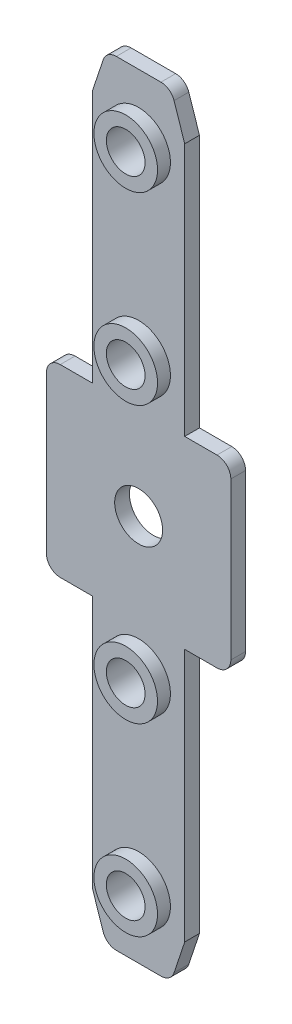
ISO-10303-21;
HEADER;
FILE_DESCRIPTION(('STEP AP214'),'2;1');
FILE_NAME('part.step','',(''),(''),'','','');
FILE_SCHEMA(('AUTOMOTIVE_DESIGN { 1 0 10303 214 1 1 1 1 }'));
ENDSEC;
DATA;
#1=APPLICATION_CONTEXT('core data for automotive mechanical design processes');
#2=APPLICATION_PROTOCOL_DEFINITION('international standard','automotive_design',2000,#1);
#3=PRODUCT_CONTEXT('',#1,'mechanical');
#4=PRODUCT('Part','Part','',(#3));
#5=PRODUCT_RELATED_PRODUCT_CATEGORY('part','',(#4));
#6=PRODUCT_DEFINITION_FORMATION('','',#4);
#7=PRODUCT_DEFINITION_CONTEXT('part definition',#1,'design');
#8=PRODUCT_DEFINITION('design','',#6,#7);
#9=PRODUCT_DEFINITION_SHAPE('','',#8);
#10=(LENGTH_UNIT() NAMED_UNIT(*) SI_UNIT(.MILLI.,.METRE.));
#11=(NAMED_UNIT(*) PLANE_ANGLE_UNIT() SI_UNIT($,.RADIAN.));
#12=(NAMED_UNIT(*) SI_UNIT($,.STERADIAN.) SOLID_ANGLE_UNIT());
#13=UNCERTAINTY_MEASURE_WITH_UNIT(LENGTH_MEASURE(1.E-05),#10,'distance_accuracy_value','');
#14=(GEOMETRIC_REPRESENTATION_CONTEXT(3) GLOBAL_UNCERTAINTY_ASSIGNED_CONTEXT((#13)) GLOBAL_UNIT_ASSIGNED_CONTEXT((#10,
#11,#12)) REPRESENTATION_CONTEXT('',''));
#15=CARTESIAN_POINT('',(0.,0.,0.));
#16=DIRECTION('',(0.,0.,1.));
#17=DIRECTION('',(1.,0.,0.));
#18=AXIS2_PLACEMENT_3D('',#15,#16,#17);
#19=CARTESIAN_POINT('',(-2.41886116991581,40.485,1.6));
#20=DIRECTION('',(0.,0.,-1.));
#21=DIRECTION('',(-1.,0.,0.));
#22=AXIS2_PLACEMENT_3D('',#19,#20,#21);
#23=PLANE('',#22);
#24=CARTESIAN_POINT('',(0.,-14.95,1.6));
#25=DIRECTION('',(0.,0.,-1.));
#26=DIRECTION('',(-1.,0.,0.));
#27=AXIS2_PLACEMENT_3D('',#24,#25,#26);
#28=CIRCLE('',#27,3.45);
#29=CARTESIAN_POINT('',(-3.45,-14.95,1.6));
#30=VERTEX_POINT('',#29);
#31=EDGE_CURVE('E44',#30,#30,#28,.F.);
#32=ORIENTED_EDGE('',*,*,#31,.F.);
#33=EDGE_LOOP('',(#32));
#34=FACE_BOUND('',#33,.T.);
#35=CARTESIAN_POINT('',(0.,14.95,1.6));
#36=DIRECTION('',(0.,0.,-1.));
#37=DIRECTION('',(-1.,0.,0.));
#38=AXIS2_PLACEMENT_3D('',#35,#36,#37);
#39=CIRCLE('',#38,3.45);
#40=CARTESIAN_POINT('',(-3.45,14.95,1.6));
#41=VERTEX_POINT('',#40);
#42=EDGE_CURVE('E339',#41,#41,#39,.F.);
#43=ORIENTED_EDGE('',*,*,#42,.F.);
#44=EDGE_LOOP('',(#43));
#45=FACE_BOUND('',#44,.T.);
#46=DIRECTION('',(0.,-1.,0.));
#47=VECTOR('',#46,1.);
#48=CARTESIAN_POINT('',(-5.,10.,1.6));
#49=LINE('',#48,#47);
#50=CARTESIAN_POINT('',(-5.,37.485,1.6));
#51=VERTEX_POINT('',#50);
#52=CARTESIAN_POINT('',(-5.,10.,1.6));
#53=VERTEX_POINT('',#52);
#54=EDGE_CURVE('E276',#51,#53,#49,.T.);
#55=ORIENTED_EDGE('',*,*,#54,.T.);
#56=DIRECTION('',(-1.,0.,0.));
#57=VECTOR('',#56,1.);
#58=CARTESIAN_POINT('',(-8.49999999999999,10.,1.6));
#59=LINE('',#58,#57);
#60=CARTESIAN_POINT('',(-8.49999999999999,10.,1.6));
#61=VERTEX_POINT('',#60);
#62=EDGE_CURVE('E144',#53,#61,#59,.T.);
#63=ORIENTED_EDGE('',*,*,#62,.T.);
#64=CARTESIAN_POINT('',(-8.5,8.5,1.6));
#65=DIRECTION('',(0.,0.,1.));
#66=DIRECTION('',(-1.,0.,0.));
#67=AXIS2_PLACEMENT_3D('',#64,#65,#66);
#68=CIRCLE('',#67,1.5);
#69=CARTESIAN_POINT('',(-10.,8.49999999999999,1.6));
#70=VERTEX_POINT('',#69);
#71=EDGE_CURVE('E470',#61,#70,#68,.T.);
#72=ORIENTED_EDGE('',*,*,#71,.T.);
#73=DIRECTION('',(0.,-1.,0.));
#74=VECTOR('',#73,1.);
#75=CARTESIAN_POINT('',(-10.,-8.49999999999999,1.6));
#76=LINE('',#75,#74);
#77=CARTESIAN_POINT('',(-10.,-8.49999999999999,1.6));
#78=VERTEX_POINT('',#77);
#79=EDGE_CURVE('E482',#70,#78,#76,.T.);
#80=ORIENTED_EDGE('',*,*,#79,.T.);
#81=CARTESIAN_POINT('',(-8.5,-8.5,1.6));
#82=DIRECTION('',(0.,0.,1.));
#83=DIRECTION('',(-1.,0.,0.));
#84=AXIS2_PLACEMENT_3D('',#81,#82,#83);
#85=CIRCLE('',#84,1.5);
#86=CARTESIAN_POINT('',(-8.49999999999999,-10.,1.6));
#87=VERTEX_POINT('',#86);
#88=EDGE_CURVE('E479',#78,#87,#85,.T.);
#89=ORIENTED_EDGE('',*,*,#88,.T.);
#90=DIRECTION('',(1.,0.,0.));
#91=VECTOR('',#90,1.);
#92=CARTESIAN_POINT('',(-8.49999999999999,-10.,1.6));
#93=LINE('',#92,#91);
#94=CARTESIAN_POINT('',(-5.,-10.,1.6));
#95=VERTEX_POINT('',#94);
#96=EDGE_CURVE('E481',#87,#95,#93,.T.);
#97=ORIENTED_EDGE('',*,*,#96,.T.);
#98=DIRECTION('',(0.,-1.,0.));
#99=VECTOR('',#98,1.);
#100=CARTESIAN_POINT('',(-5.,-10.,1.6));
#101=LINE('',#100,#99);
#102=CARTESIAN_POINT('',(-5.,-37.485,1.6));
#103=VERTEX_POINT('',#102);
#104=EDGE_CURVE('E484',#95,#103,#101,.T.);
#105=ORIENTED_EDGE('',*,*,#104,.T.);
#106=DIRECTION('',(0.316227766016838,-0.948683298050514,0.));
#107=VECTOR('',#106,1.);
#108=CARTESIAN_POINT('',(-5.,-37.485,1.6));
#109=LINE('',#108,#107);
#110=CARTESIAN_POINT('',(-3.84188611699158,-40.9593416490252,1.6));
#111=VERTEX_POINT('',#110);
#112=EDGE_CURVE('E490',#103,#111,#109,.T.);
#113=ORIENTED_EDGE('',*,*,#112,.T.);
#114=CARTESIAN_POINT('',(-2.41886116991581,-40.485,1.6));
#115=DIRECTION('',(0.,0.,1.));
#116=DIRECTION('',(-1.,0.,0.));
#117=AXIS2_PLACEMENT_3D('',#114,#115,#116);
#118=CIRCLE('',#117,1.5);
#119=CARTESIAN_POINT('',(-2.4188611699158,-41.985,1.6));
#120=VERTEX_POINT('',#119);
#121=EDGE_CURVE('E492',#111,#120,#118,.T.);
#122=ORIENTED_EDGE('',*,*,#121,.T.);
#123=DIRECTION('',(1.,0.,0.));
#124=VECTOR('',#123,1.);
#125=CARTESIAN_POINT('',(-2.4188611699158,-41.985,1.6));
#126=LINE('',#125,#124);
#127=CARTESIAN_POINT('',(2.4188611699158,-41.985,1.6));
#128=VERTEX_POINT('',#127);
#129=EDGE_CURVE('E494',#120,#128,#126,.T.);
#130=ORIENTED_EDGE('',*,*,#129,.T.);
#131=CARTESIAN_POINT('',(2.41886116991581,-40.485,1.6));
#132=DIRECTION('',(0.,0.,1.));
#133=DIRECTION('',(-1.,0.,0.));
#134=AXIS2_PLACEMENT_3D('',#131,#132,#133);
#135=CIRCLE('',#134,1.5);
#136=CARTESIAN_POINT('',(3.84188611699158,-40.9593416490252,1.6));
#137=VERTEX_POINT('',#136);
#138=EDGE_CURVE('E496',#128,#137,#135,.T.);
#139=ORIENTED_EDGE('',*,*,#138,.T.);
#140=DIRECTION('',(0.316227766016838,0.948683298050514,0.));
#141=VECTOR('',#140,1.);
#142=CARTESIAN_POINT('',(5.,-37.485,1.6));
#143=LINE('',#142,#141);
#144=CARTESIAN_POINT('',(5.,-37.485,1.6));
#145=VERTEX_POINT('',#144);
#146=EDGE_CURVE('E498',#137,#145,#143,.T.);
#147=ORIENTED_EDGE('',*,*,#146,.T.);
#148=DIRECTION('',(0.,1.,0.));
#149=VECTOR('',#148,1.);
#150=CARTESIAN_POINT('',(5.,-10.,1.6));
#151=LINE('',#150,#149);
#152=CARTESIAN_POINT('',(5.,-10.,1.6));
#153=VERTEX_POINT('',#152);
#154=EDGE_CURVE('E500',#145,#153,#151,.T.);
#155=ORIENTED_EDGE('',*,*,#154,.T.);
#156=DIRECTION('',(1.,0.,0.));
#157=VECTOR('',#156,1.);
#158=CARTESIAN_POINT('',(8.49999999999999,-10.,1.6));
#159=LINE('',#158,#157);
#160=CARTESIAN_POINT('',(8.49999999999999,-10.,1.6));
#161=VERTEX_POINT('',#160);
#162=EDGE_CURVE('E502',#153,#161,#159,.T.);
#163=ORIENTED_EDGE('',*,*,#162,.T.);
#164=CARTESIAN_POINT('',(8.5,-8.5,1.6));
#165=DIRECTION('',(0.,0.,1.));
#166=DIRECTION('',(1.,0.,0.));
#167=AXIS2_PLACEMENT_3D('',#164,#165,#166);
#168=CIRCLE('',#167,1.5);
#169=CARTESIAN_POINT('',(10.,-8.49999999999999,1.6));
#170=VERTEX_POINT('',#169);
#171=EDGE_CURVE('E504',#161,#170,#168,.T.);
#172=ORIENTED_EDGE('',*,*,#171,.T.);
#173=DIRECTION('',(0.,1.,0.));
#174=VECTOR('',#173,1.);
#175=CARTESIAN_POINT('',(10.,-8.49999999999999,1.6));
#176=LINE('',#175,#174);
#177=CARTESIAN_POINT('',(10.,8.49999999999999,1.6));
#178=VERTEX_POINT('',#177);
#179=EDGE_CURVE('E506',#170,#178,#176,.T.);
#180=ORIENTED_EDGE('',*,*,#179,.T.);
#181=CARTESIAN_POINT('',(8.5,8.5,1.6));
#182=DIRECTION('',(0.,0.,1.));
#183=DIRECTION('',(-1.,0.,0.));
#184=AXIS2_PLACEMENT_3D('',#181,#182,#183);
#185=CIRCLE('',#184,1.5);
#186=CARTESIAN_POINT('',(8.49999999999999,10.,1.6));
#187=VERTEX_POINT('',#186);
#188=EDGE_CURVE('E508',#178,#187,#185,.T.);
#189=ORIENTED_EDGE('',*,*,#188,.T.);
#190=DIRECTION('',(-1.,0.,0.));
#191=VECTOR('',#190,1.);
#192=CARTESIAN_POINT('',(8.49999999999999,10.,1.6));
#193=LINE('',#192,#191);
#194=CARTESIAN_POINT('',(5.,10.,1.6));
#195=VERTEX_POINT('',#194);
#196=EDGE_CURVE('E510',#187,#195,#193,.T.);
#197=ORIENTED_EDGE('',*,*,#196,.T.);
#198=DIRECTION('',(0.,1.,0.));
#199=VECTOR('',#198,1.);
#200=CARTESIAN_POINT('',(5.,10.,1.6));
#201=LINE('',#200,#199);
#202=CARTESIAN_POINT('',(5.,37.485,1.6));
#203=VERTEX_POINT('',#202);
#204=EDGE_CURVE('E512',#195,#203,#201,.T.);
#205=ORIENTED_EDGE('',*,*,#204,.T.);
#206=DIRECTION('',(-0.316227766016837,0.948683298050514,0.));
#207=VECTOR('',#206,1.);
#208=CARTESIAN_POINT('',(5.,37.485,1.6));
#209=LINE('',#208,#207);
#210=CARTESIAN_POINT('',(3.84188611699158,40.9593416490253,1.6));
#211=VERTEX_POINT('',#210);
#212=EDGE_CURVE('E514',#203,#211,#209,.T.);
#213=ORIENTED_EDGE('',*,*,#212,.T.);
#214=CARTESIAN_POINT('',(2.41886116991581,40.485,1.6));
#215=DIRECTION('',(0.,0.,1.));
#216=DIRECTION('',(1.,0.,0.));
#217=AXIS2_PLACEMENT_3D('',#214,#215,#216);
#218=CIRCLE('',#217,1.5);
#219=CARTESIAN_POINT('',(2.4188611699158,41.985,1.6));
#220=VERTEX_POINT('',#219);
#221=EDGE_CURVE('E211',#211,#220,#218,.T.);
#222=ORIENTED_EDGE('',*,*,#221,.T.);
#223=DIRECTION('',(-1.,0.,0.));
#224=VECTOR('',#223,1.);
#225=CARTESIAN_POINT('',(-2.4188611699158,41.985,1.6));
#226=LINE('',#225,#224);
#227=CARTESIAN_POINT('',(-2.4188611699158,41.985,1.6));
#228=VERTEX_POINT('',#227);
#229=EDGE_CURVE('E205',#220,#228,#226,.T.);
#230=ORIENTED_EDGE('',*,*,#229,.T.);
#231=CARTESIAN_POINT('',(-2.41886116991581,40.485,1.6));
#232=DIRECTION('',(0.,0.,1.));
#233=DIRECTION('',(-1.,0.,0.));
#234=AXIS2_PLACEMENT_3D('',#231,#232,#233);
#235=CIRCLE('',#234,1.5);
#236=CARTESIAN_POINT('',(-3.84188611699158,40.9593416490252,1.6));
#237=VERTEX_POINT('',#236);
#238=EDGE_CURVE('E209',#228,#237,#235,.T.);
#239=ORIENTED_EDGE('',*,*,#238,.T.);
#240=DIRECTION('',(-0.316227766016838,-0.948683298050514,0.));
#241=VECTOR('',#240,1.);
#242=CARTESIAN_POINT('',(-5.,37.485,1.6));
#243=LINE('',#242,#241);
#244=EDGE_CURVE('E52',#237,#51,#243,.T.);
#245=ORIENTED_EDGE('',*,*,#244,.T.);
#246=EDGE_LOOP('',(#55,#63,#72,#80,#89,#97,#105,#113,#122,#130,#139,#147,#155,#163,#172,#180,
#189,#197,#205,#213,#222,#230,#239,#245));
#247=FACE_BOUND('',#246,.T.);
#248=CARTESIAN_POINT('',(0.,0.,1.6));
#249=DIRECTION('',(0.,0.,1.));
#250=DIRECTION('',(1.,0.,0.));
#251=AXIS2_PLACEMENT_3D('',#248,#249,#250);
#252=CIRCLE('',#251,2.6);
#253=CARTESIAN_POINT('',(2.6,0.,1.6));
#254=VERTEX_POINT('',#253);
#255=EDGE_CURVE('E233',#254,#254,#252,.T.);
#256=ORIENTED_EDGE('',*,*,#255,.F.);
#257=EDGE_LOOP('',(#256));
#258=FACE_BOUND('',#257,.T.);
#259=CARTESIAN_POINT('',(0.,34.95,1.6));
#260=DIRECTION('',(0.,0.,-1.));
#261=DIRECTION('',(-1.,0.,0.));
#262=AXIS2_PLACEMENT_3D('',#259,#260,#261);
#263=CIRCLE('',#262,3.45);
#264=CARTESIAN_POINT('',(-3.45,34.95,1.6));
#265=VERTEX_POINT('',#264);
#266=EDGE_CURVE('E342',#265,#265,#263,.F.);
#267=ORIENTED_EDGE('',*,*,#266,.F.);
#268=EDGE_LOOP('',(#267));
#269=FACE_BOUND('',#268,.T.);
#270=CARTESIAN_POINT('',(0.,-34.95,1.6));
#271=DIRECTION('',(0.,0.,-1.));
#272=DIRECTION('',(-1.,0.,0.));
#273=AXIS2_PLACEMENT_3D('',#270,#271,#272);
#274=CIRCLE('',#273,3.45);
#275=CARTESIAN_POINT('',(-3.45,-34.95,1.6));
#276=VERTEX_POINT('',#275);
#277=EDGE_CURVE('E11',#276,#276,#274,.F.);
#278=ORIENTED_EDGE('',*,*,#277,.F.);
#279=EDGE_LOOP('',(#278));
#280=FACE_BOUND('',#279,.T.);
#281=ADVANCED_FACE('F35',(#34,#45,#247,#258,#269,#280),#23,.F.);
#282=CARTESIAN_POINT('',(-2.41886116991581,40.485,0.));
#283=DIRECTION('',(0.,0.,-1.));
#284=DIRECTION('',(-1.,0.,0.));
#285=AXIS2_PLACEMENT_3D('',#282,#283,#284);
#286=PLANE('',#285);
#287=CARTESIAN_POINT('',(0.,34.95,0.));
#288=DIRECTION('',(0.,0.,1.));
#289=DIRECTION('',(1.,0.,0.));
#290=AXIS2_PLACEMENT_3D('',#287,#288,#289);
#291=CIRCLE('',#290,2.1);
#292=CARTESIAN_POINT('',(2.1,34.95,0.));
#293=VERTEX_POINT('',#292);
#294=EDGE_CURVE('E560',#293,#293,#291,.T.);
#295=ORIENTED_EDGE('',*,*,#294,.T.);
#296=EDGE_LOOP('',(#295));
#297=FACE_BOUND('',#296,.T.);
#298=CARTESIAN_POINT('',(0.,14.95,0.));
#299=DIRECTION('',(0.,0.,1.));
#300=DIRECTION('',(1.,0.,0.));
#301=AXIS2_PLACEMENT_3D('',#298,#299,#300);
#302=CIRCLE('',#301,2.1);
#303=CARTESIAN_POINT('',(2.1,14.95,0.));
#304=VERTEX_POINT('',#303);
#305=EDGE_CURVE('E554',#304,#304,#302,.T.);
#306=ORIENTED_EDGE('',*,*,#305,.T.);
#307=EDGE_LOOP('',(#306));
#308=FACE_BOUND('',#307,.T.);
#309=CARTESIAN_POINT('',(0.,-14.95,0.));
#310=DIRECTION('',(0.,0.,1.));
#311=DIRECTION('',(1.,0.,0.));
#312=AXIS2_PLACEMENT_3D('',#309,#310,#311);
#313=CIRCLE('',#312,2.1);
#314=CARTESIAN_POINT('',(2.1,-14.95,0.));
#315=VERTEX_POINT('',#314);
#316=EDGE_CURVE('E548',#315,#315,#313,.T.);
#317=ORIENTED_EDGE('',*,*,#316,.T.);
#318=EDGE_LOOP('',(#317));
#319=FACE_BOUND('',#318,.T.);
#320=CARTESIAN_POINT('',(0.,-34.95,0.));
#321=DIRECTION('',(0.,0.,1.));
#322=DIRECTION('',(1.,0.,0.));
#323=AXIS2_PLACEMENT_3D('',#320,#321,#322);
#324=CIRCLE('',#323,2.1);
#325=CARTESIAN_POINT('',(2.1,-34.95,0.));
#326=VERTEX_POINT('',#325);
#327=EDGE_CURVE('E542',#326,#326,#324,.T.);
#328=ORIENTED_EDGE('',*,*,#327,.T.);
#329=EDGE_LOOP('',(#328));
#330=FACE_BOUND('',#329,.T.);
#331=DIRECTION('',(0.,-1.,0.));
#332=VECTOR('',#331,1.);
#333=CARTESIAN_POINT('',(-5.,10.,0.));
#334=LINE('',#333,#332);
#335=CARTESIAN_POINT('',(-5.,37.485,0.));
#336=VERTEX_POINT('',#335);
#337=CARTESIAN_POINT('',(-5.,10.,0.));
#338=VERTEX_POINT('',#337);
#339=EDGE_CURVE('E229',#336,#338,#334,.T.);
#340=ORIENTED_EDGE('',*,*,#339,.F.);
#341=DIRECTION('',(-0.316227766016838,-0.948683298050514,0.));
#342=VECTOR('',#341,1.);
#343=CARTESIAN_POINT('',(-5.,37.485,0.));
#344=LINE('',#343,#342);
#345=CARTESIAN_POINT('',(-3.84188611699158,40.9593416490252,0.));
#346=VERTEX_POINT('',#345);
#347=EDGE_CURVE('E135',#346,#336,#344,.T.);
#348=ORIENTED_EDGE('',*,*,#347,.F.);
#349=CARTESIAN_POINT('',(-2.41886116991581,40.485,0.));
#350=DIRECTION('',(0.,0.,1.));
#351=DIRECTION('',(-1.,0.,0.));
#352=AXIS2_PLACEMENT_3D('',#349,#350,#351);
#353=CIRCLE('',#352,1.5);
#354=CARTESIAN_POINT('',(-2.4188611699158,41.985,0.));
#355=VERTEX_POINT('',#354);
#356=EDGE_CURVE('E129',#355,#346,#353,.T.);
#357=ORIENTED_EDGE('',*,*,#356,.F.);
#358=DIRECTION('',(-1.,0.,0.));
#359=VECTOR('',#358,1.);
#360=CARTESIAN_POINT('',(-2.4188611699158,41.985,0.));
#361=LINE('',#360,#359);
#362=CARTESIAN_POINT('',(2.4188611699158,41.985,0.));
#363=VERTEX_POINT('',#362);
#364=EDGE_CURVE('E219',#363,#355,#361,.T.);
#365=ORIENTED_EDGE('',*,*,#364,.F.);
#366=CARTESIAN_POINT('',(2.41886116991581,40.485,0.));
#367=DIRECTION('',(0.,0.,1.));
#368=DIRECTION('',(1.,0.,0.));
#369=AXIS2_PLACEMENT_3D('',#366,#367,#368);
#370=CIRCLE('',#369,1.5);
#371=CARTESIAN_POINT('',(3.84188611699158,40.9593416490253,0.));
#372=VERTEX_POINT('',#371);
#373=EDGE_CURVE('E271',#372,#363,#370,.T.);
#374=ORIENTED_EDGE('',*,*,#373,.F.);
#375=DIRECTION('',(-0.316227766016837,0.948683298050514,0.));
#376=VECTOR('',#375,1.);
#377=CARTESIAN_POINT('',(5.,37.485,0.));
#378=LINE('',#377,#376);
#379=CARTESIAN_POINT('',(5.,37.485,0.));
#380=VERTEX_POINT('',#379);
#381=EDGE_CURVE('E269',#380,#372,#378,.T.);
#382=ORIENTED_EDGE('',*,*,#381,.F.);
#383=DIRECTION('',(0.,1.,0.));
#384=VECTOR('',#383,1.);
#385=CARTESIAN_POINT('',(5.,10.,0.));
#386=LINE('',#385,#384);
#387=CARTESIAN_POINT('',(5.,10.,0.));
#388=VERTEX_POINT('',#387);
#389=EDGE_CURVE('E267',#388,#380,#386,.T.);
#390=ORIENTED_EDGE('',*,*,#389,.F.);
#391=DIRECTION('',(-1.,0.,0.));
#392=VECTOR('',#391,1.);
#393=CARTESIAN_POINT('',(8.49999999999999,10.,0.));
#394=LINE('',#393,#392);
#395=CARTESIAN_POINT('',(8.49999999999999,10.,0.));
#396=VERTEX_POINT('',#395);
#397=EDGE_CURVE('E265',#396,#388,#394,.T.);
#398=ORIENTED_EDGE('',*,*,#397,.F.);
#399=CARTESIAN_POINT('',(8.5,8.5,0.));
#400=DIRECTION('',(0.,0.,1.));
#401=DIRECTION('',(-1.,0.,0.));
#402=AXIS2_PLACEMENT_3D('',#399,#400,#401);
#403=CIRCLE('',#402,1.5);
#404=CARTESIAN_POINT('',(10.,8.49999999999999,0.));
#405=VERTEX_POINT('',#404);
#406=EDGE_CURVE('E263',#405,#396,#403,.T.);
#407=ORIENTED_EDGE('',*,*,#406,.F.);
#408=DIRECTION('',(0.,1.,0.));
#409=VECTOR('',#408,1.);
#410=CARTESIAN_POINT('',(10.,-8.49999999999999,0.));
#411=LINE('',#410,#409);
#412=CARTESIAN_POINT('',(10.,-8.49999999999999,0.));
#413=VERTEX_POINT('',#412);
#414=EDGE_CURVE('E261',#413,#405,#411,.T.);
#415=ORIENTED_EDGE('',*,*,#414,.F.);
#416=CARTESIAN_POINT('',(8.5,-8.5,0.));
#417=DIRECTION('',(0.,0.,1.));
#418=DIRECTION('',(1.,0.,0.));
#419=AXIS2_PLACEMENT_3D('',#416,#417,#418);
#420=CIRCLE('',#419,1.5);
#421=CARTESIAN_POINT('',(8.49999999999999,-10.,0.));
#422=VERTEX_POINT('',#421);
#423=EDGE_CURVE('E259',#422,#413,#420,.T.);
#424=ORIENTED_EDGE('',*,*,#423,.F.);
#425=DIRECTION('',(1.,0.,0.));
#426=VECTOR('',#425,1.);
#427=CARTESIAN_POINT('',(8.49999999999999,-10.,0.));
#428=LINE('',#427,#426);
#429=CARTESIAN_POINT('',(5.,-10.,0.));
#430=VERTEX_POINT('',#429);
#431=EDGE_CURVE('E257',#430,#422,#428,.T.);
#432=ORIENTED_EDGE('',*,*,#431,.F.);
#433=DIRECTION('',(0.,1.,0.));
#434=VECTOR('',#433,1.);
#435=CARTESIAN_POINT('',(5.,-10.,0.));
#436=LINE('',#435,#434);
#437=CARTESIAN_POINT('',(5.,-37.485,0.));
#438=VERTEX_POINT('',#437);
#439=EDGE_CURVE('E255',#438,#430,#436,.T.);
#440=ORIENTED_EDGE('',*,*,#439,.F.);
#441=DIRECTION('',(0.316227766016838,0.948683298050514,0.));
#442=VECTOR('',#441,1.);
#443=CARTESIAN_POINT('',(5.,-37.485,0.));
#444=LINE('',#443,#442);
#445=CARTESIAN_POINT('',(3.84188611699158,-40.9593416490252,0.));
#446=VERTEX_POINT('',#445);
#447=EDGE_CURVE('E253',#446,#438,#444,.T.);
#448=ORIENTED_EDGE('',*,*,#447,.F.);
#449=CARTESIAN_POINT('',(2.41886116991581,-40.485,0.));
#450=DIRECTION('',(0.,0.,1.));
#451=DIRECTION('',(-1.,0.,0.));
#452=AXIS2_PLACEMENT_3D('',#449,#450,#451);
#453=CIRCLE('',#452,1.5);
#454=CARTESIAN_POINT('',(2.4188611699158,-41.985,0.));
#455=VERTEX_POINT('',#454);
#456=EDGE_CURVE('E251',#455,#446,#453,.T.);
#457=ORIENTED_EDGE('',*,*,#456,.F.);
#458=DIRECTION('',(1.,0.,0.));
#459=VECTOR('',#458,1.);
#460=CARTESIAN_POINT('',(-2.4188611699158,-41.985,0.));
#461=LINE('',#460,#459);
#462=CARTESIAN_POINT('',(-2.4188611699158,-41.985,0.));
#463=VERTEX_POINT('',#462);
#464=EDGE_CURVE('E249',#463,#455,#461,.T.);
#465=ORIENTED_EDGE('',*,*,#464,.F.);
#466=CARTESIAN_POINT('',(-2.41886116991581,-40.485,0.));
#467=DIRECTION('',(0.,0.,1.));
#468=DIRECTION('',(-1.,0.,0.));
#469=AXIS2_PLACEMENT_3D('',#466,#467,#468);
#470=CIRCLE('',#469,1.5);
#471=CARTESIAN_POINT('',(-3.84188611699158,-40.9593416490252,0.));
#472=VERTEX_POINT('',#471);
#473=EDGE_CURVE('E247',#472,#463,#470,.T.);
#474=ORIENTED_EDGE('',*,*,#473,.F.);
#475=DIRECTION('',(0.316227766016838,-0.948683298050514,0.));
#476=VECTOR('',#475,1.);
#477=CARTESIAN_POINT('',(-5.,-37.485,0.));
#478=LINE('',#477,#476);
#479=CARTESIAN_POINT('',(-5.,-37.485,0.));
#480=VERTEX_POINT('',#479);
#481=EDGE_CURVE('E245',#480,#472,#478,.T.);
#482=ORIENTED_EDGE('',*,*,#481,.F.);
#483=DIRECTION('',(0.,-1.,0.));
#484=VECTOR('',#483,1.);
#485=CARTESIAN_POINT('',(-5.,-10.,0.));
#486=LINE('',#485,#484);
#487=CARTESIAN_POINT('',(-5.,-10.,0.));
#488=VERTEX_POINT('',#487);
#489=EDGE_CURVE('E243',#488,#480,#486,.T.);
#490=ORIENTED_EDGE('',*,*,#489,.F.);
#491=DIRECTION('',(1.,0.,0.));
#492=VECTOR('',#491,1.);
#493=CARTESIAN_POINT('',(-8.49999999999999,-10.,0.));
#494=LINE('',#493,#492);
#495=CARTESIAN_POINT('',(-8.49999999999999,-10.,0.));
#496=VERTEX_POINT('',#495);
#497=EDGE_CURVE('E241',#496,#488,#494,.T.);
#498=ORIENTED_EDGE('',*,*,#497,.F.);
#499=CARTESIAN_POINT('',(-8.5,-8.5,0.));
#500=DIRECTION('',(0.,0.,1.));
#501=DIRECTION('',(-1.,0.,0.));
#502=AXIS2_PLACEMENT_3D('',#499,#500,#501);
#503=CIRCLE('',#502,1.5);
#504=CARTESIAN_POINT('',(-10.,-8.49999999999999,0.));
#505=VERTEX_POINT('',#504);
#506=EDGE_CURVE('E239',#505,#496,#503,.T.);
#507=ORIENTED_EDGE('',*,*,#506,.F.);
#508=DIRECTION('',(0.,-1.,0.));
#509=VECTOR('',#508,1.);
#510=CARTESIAN_POINT('',(-10.,-8.49999999999999,0.));
#511=LINE('',#510,#509);
#512=CARTESIAN_POINT('',(-10.,8.49999999999999,0.));
#513=VERTEX_POINT('',#512);
#514=EDGE_CURVE('E237',#513,#505,#511,.T.);
#515=ORIENTED_EDGE('',*,*,#514,.F.);
#516=CARTESIAN_POINT('',(-8.5,8.5,0.));
#517=DIRECTION('',(0.,0.,1.));
#518=DIRECTION('',(-1.,0.,0.));
#519=AXIS2_PLACEMENT_3D('',#516,#517,#518);
#520=CIRCLE('',#519,1.5);
#521=CARTESIAN_POINT('',(-8.49999999999999,10.,0.));
#522=VERTEX_POINT('',#521);
#523=EDGE_CURVE('E235',#522,#513,#520,.T.);
#524=ORIENTED_EDGE('',*,*,#523,.F.);
#525=DIRECTION('',(-1.,0.,0.));
#526=VECTOR('',#525,1.);
#527=CARTESIAN_POINT('',(-8.49999999999999,10.,0.));
#528=LINE('',#527,#526);
#529=EDGE_CURVE('E232',#338,#522,#528,.T.);
#530=ORIENTED_EDGE('',*,*,#529,.F.);
#531=EDGE_LOOP('',(#340,#348,#357,#365,#374,#382,#390,#398,#407,#415,#424,#432,#440,#448,#457,
#465,#474,#482,#490,#498,#507,#515,#524,#530));
#532=FACE_BOUND('',#531,.T.);
#533=CARTESIAN_POINT('',(0.,0.,0.));
#534=DIRECTION('',(0.,0.,1.));
#535=DIRECTION('',(1.,0.,0.));
#536=AXIS2_PLACEMENT_3D('',#533,#534,#535);
#537=CIRCLE('',#536,2.6);
#538=CARTESIAN_POINT('',(2.6,0.,0.));
#539=VERTEX_POINT('',#538);
#540=EDGE_CURVE('E525',#539,#539,#537,.T.);
#541=ORIENTED_EDGE('',*,*,#540,.T.);
#542=EDGE_LOOP('',(#541));
#543=FACE_BOUND('',#542,.T.);
#544=ADVANCED_FACE('F351',(#297,#308,#319,#330,#532,#543),#286,.T.);
#545=CARTESIAN_POINT('',(-5.,10.,1.6));
#546=DIRECTION('',(1.,0.,0.));
#547=DIRECTION('',(0.,1.,0.));
#548=AXIS2_PLACEMENT_3D('',#545,#546,#547);
#549=PLANE('',#548);
#550=ORIENTED_EDGE('',*,*,#339,.T.);
#551=DIRECTION('',(0.,0.,-1.));
#552=VECTOR('',#551,1.);
#553=CARTESIAN_POINT('',(-5.,10.,1.6));
#554=LINE('',#553,#552);
#555=EDGE_CURVE('E337',#53,#338,#554,.T.);
#556=ORIENTED_EDGE('',*,*,#555,.F.);
#557=ORIENTED_EDGE('',*,*,#54,.F.);
#558=DIRECTION('',(0.,0.,-1.));
#559=VECTOR('',#558,1.);
#560=CARTESIAN_POINT('',(-5.,37.485,1.6));
#561=LINE('',#560,#559);
#562=EDGE_CURVE('E225',#51,#336,#561,.T.);
#563=ORIENTED_EDGE('',*,*,#562,.T.);
#564=EDGE_LOOP('',(#550,#556,#557,#563));
#565=FACE_BOUND('',#564,.T.);
#566=ADVANCED_FACE('F37',(#565),#549,.F.);
#567=CARTESIAN_POINT('',(-8.49999999999999,10.,1.6));
#568=DIRECTION('',(0.,-1.,0.));
#569=DIRECTION('',(1.,0.,0.));
#570=AXIS2_PLACEMENT_3D('',#567,#568,#569);
#571=PLANE('',#570);
#572=ORIENTED_EDGE('',*,*,#529,.T.);
#573=DIRECTION('',(0.,0.,-1.));
#574=VECTOR('',#573,1.);
#575=CARTESIAN_POINT('',(-8.49999999999999,10.,1.6));
#576=LINE('',#575,#574);
#577=EDGE_CURVE('E334',#61,#522,#576,.T.);
#578=ORIENTED_EDGE('',*,*,#577,.F.);
#579=ORIENTED_EDGE('',*,*,#62,.F.);
#580=ORIENTED_EDGE('',*,*,#555,.T.);
#581=EDGE_LOOP('',(#572,#578,#579,#580));
#582=FACE_BOUND('',#581,.T.);
#583=ADVANCED_FACE('F457',(#582),#571,.F.);
#584=CARTESIAN_POINT('',(-8.5,8.5,1.6));
#585=DIRECTION('',(0.,0.,-1.));
#586=DIRECTION('',(-1.,0.,0.));
#587=AXIS2_PLACEMENT_3D('',#584,#585,#586);
#588=CYLINDRICAL_SURFACE('',#587,1.5);
#589=ORIENTED_EDGE('',*,*,#523,.T.);
#590=DIRECTION('',(0.,0.,-1.));
#591=VECTOR('',#590,1.);
#592=CARTESIAN_POINT('',(-10.,8.49999999999999,1.6));
#593=LINE('',#592,#591);
#594=EDGE_CURVE('E331',#70,#513,#593,.T.);
#595=ORIENTED_EDGE('',*,*,#594,.F.);
#596=ORIENTED_EDGE('',*,*,#71,.F.);
#597=ORIENTED_EDGE('',*,*,#577,.T.);
#598=EDGE_LOOP('',(#589,#595,#596,#597));
#599=FACE_BOUND('',#598,.T.);
#600=ADVANCED_FACE('F454',(#599),#588,.T.);
#601=CARTESIAN_POINT('',(-10.,-8.49999999999999,1.6));
#602=DIRECTION('',(1.,0.,0.));
#603=DIRECTION('',(0.,0.,-1.));
#604=AXIS2_PLACEMENT_3D('',#601,#602,#603);
#605=PLANE('',#604);
#606=ORIENTED_EDGE('',*,*,#514,.T.);
#607=DIRECTION('',(0.,0.,-1.));
#608=VECTOR('',#607,1.);
#609=CARTESIAN_POINT('',(-10.,-8.49999999999999,1.6));
#610=LINE('',#609,#608);
#611=EDGE_CURVE('E328',#78,#505,#610,.T.);
#612=ORIENTED_EDGE('',*,*,#611,.F.);
#613=ORIENTED_EDGE('',*,*,#79,.F.);
#614=ORIENTED_EDGE('',*,*,#594,.T.);
#615=EDGE_LOOP('',(#606,#612,#613,#614));
#616=FACE_BOUND('',#615,.T.);
#617=ADVANCED_FACE('F450',(#616),#605,.F.);
#618=CARTESIAN_POINT('',(-8.5,-8.5,1.6));
#619=DIRECTION('',(0.,0.,-1.));
#620=DIRECTION('',(-1.,0.,0.));
#621=AXIS2_PLACEMENT_3D('',#618,#619,#620);
#622=CYLINDRICAL_SURFACE('',#621,1.5);
#623=ORIENTED_EDGE('',*,*,#506,.T.);
#624=DIRECTION('',(0.,0.,-1.));
#625=VECTOR('',#624,1.);
#626=CARTESIAN_POINT('',(-8.49999999999999,-10.,1.6));
#627=LINE('',#626,#625);
#628=EDGE_CURVE('E325',#87,#496,#627,.T.);
#629=ORIENTED_EDGE('',*,*,#628,.F.);
#630=ORIENTED_EDGE('',*,*,#88,.F.);
#631=ORIENTED_EDGE('',*,*,#611,.T.);
#632=EDGE_LOOP('',(#623,#629,#630,#631));
#633=FACE_BOUND('',#632,.T.);
#634=ADVANCED_FACE('F446',(#633),#622,.T.);
#635=CARTESIAN_POINT('',(-8.49999999999999,-10.,1.6));
#636=DIRECTION('',(0.,1.,0.));
#637=DIRECTION('',(-1.,0.,0.));
#638=AXIS2_PLACEMENT_3D('',#635,#636,#637);
#639=PLANE('',#638);
#640=ORIENTED_EDGE('',*,*,#497,.T.);
#641=DIRECTION('',(0.,0.,-1.));
#642=VECTOR('',#641,1.);
#643=CARTESIAN_POINT('',(-5.,-10.,1.6));
#644=LINE('',#643,#642);
#645=EDGE_CURVE('E322',#95,#488,#644,.T.);
#646=ORIENTED_EDGE('',*,*,#645,.F.);
#647=ORIENTED_EDGE('',*,*,#96,.F.);
#648=ORIENTED_EDGE('',*,*,#628,.T.);
#649=EDGE_LOOP('',(#640,#646,#647,#648));
#650=FACE_BOUND('',#649,.T.);
#651=ADVANCED_FACE('F442',(#650),#639,.F.);
#652=CARTESIAN_POINT('',(-5.,-10.,1.6));
#653=DIRECTION('',(1.,0.,0.));
#654=DIRECTION('',(0.,1.,0.));
#655=AXIS2_PLACEMENT_3D('',#652,#653,#654);
#656=PLANE('',#655);
#657=ORIENTED_EDGE('',*,*,#489,.T.);
#658=DIRECTION('',(0.,0.,-1.));
#659=VECTOR('',#658,1.);
#660=CARTESIAN_POINT('',(-5.,-37.485,1.6));
#661=LINE('',#660,#659);
#662=EDGE_CURVE('E319',#103,#480,#661,.T.);
#663=ORIENTED_EDGE('',*,*,#662,.F.);
#664=ORIENTED_EDGE('',*,*,#104,.F.);
#665=ORIENTED_EDGE('',*,*,#645,.T.);
#666=EDGE_LOOP('',(#657,#663,#664,#665));
#667=FACE_BOUND('',#666,.T.);
#668=ADVANCED_FACE('F438',(#667),#656,.F.);
#669=CARTESIAN_POINT('',(-5.,-37.485,1.6));
#670=DIRECTION('',(0.948683298050514,0.316227766016838,0.));
#671=DIRECTION('',(-0.316227766016838,0.948683298050514,0.));
#672=AXIS2_PLACEMENT_3D('',#669,#670,#671);
#673=PLANE('',#672);
#674=ORIENTED_EDGE('',*,*,#481,.T.);
#675=DIRECTION('',(0.,0.,-1.));
#676=VECTOR('',#675,1.);
#677=CARTESIAN_POINT('',(-3.84188611699158,-40.9593416490252,1.6));
#678=LINE('',#677,#676);
#679=EDGE_CURVE('E316',#111,#472,#678,.T.);
#680=ORIENTED_EDGE('',*,*,#679,.F.);
#681=ORIENTED_EDGE('',*,*,#112,.F.);
#682=ORIENTED_EDGE('',*,*,#662,.T.);
#683=EDGE_LOOP('',(#674,#680,#681,#682));
#684=FACE_BOUND('',#683,.T.);
#685=ADVANCED_FACE('F434',(#684),#673,.F.);
#686=CARTESIAN_POINT('',(-2.41886116991581,-40.485,1.6));
#687=DIRECTION('',(0.,0.,-1.));
#688=DIRECTION('',(-1.,0.,0.));
#689=AXIS2_PLACEMENT_3D('',#686,#687,#688);
#690=CYLINDRICAL_SURFACE('',#689,1.5);
#691=ORIENTED_EDGE('',*,*,#473,.T.);
#692=DIRECTION('',(0.,0.,-1.));
#693=VECTOR('',#692,1.);
#694=CARTESIAN_POINT('',(-2.4188611699158,-41.985,1.6));
#695=LINE('',#694,#693);
#696=EDGE_CURVE('E313',#120,#463,#695,.T.);
#697=ORIENTED_EDGE('',*,*,#696,.F.);
#698=ORIENTED_EDGE('',*,*,#121,.F.);
#699=ORIENTED_EDGE('',*,*,#679,.T.);
#700=EDGE_LOOP('',(#691,#697,#698,#699));
#701=FACE_BOUND('',#700,.T.);
#702=ADVANCED_FACE('F430',(#701),#690,.T.);
#703=CARTESIAN_POINT('',(-2.4188611699158,-41.985,1.6));
#704=DIRECTION('',(0.,1.,0.));
#705=DIRECTION('',(0.,0.,1.));
#706=AXIS2_PLACEMENT_3D('',#703,#704,#705);
#707=PLANE('',#706);
#708=ORIENTED_EDGE('',*,*,#464,.T.);
#709=DIRECTION('',(0.,0.,-1.));
#710=VECTOR('',#709,1.);
#711=CARTESIAN_POINT('',(2.4188611699158,-41.985,1.6));
#712=LINE('',#711,#710);
#713=EDGE_CURVE('E310',#128,#455,#712,.T.);
#714=ORIENTED_EDGE('',*,*,#713,.F.);
#715=ORIENTED_EDGE('',*,*,#129,.F.);
#716=ORIENTED_EDGE('',*,*,#696,.T.);
#717=EDGE_LOOP('',(#708,#714,#715,#716));
#718=FACE_BOUND('',#717,.T.);
#719=ADVANCED_FACE('F426',(#718),#707,.F.);
#720=CARTESIAN_POINT('',(2.41886116991581,-40.485,1.6));
#721=DIRECTION('',(0.,0.,-1.));
#722=DIRECTION('',(-1.,0.,0.));
#723=AXIS2_PLACEMENT_3D('',#720,#721,#722);
#724=CYLINDRICAL_SURFACE('',#723,1.5);
#725=ORIENTED_EDGE('',*,*,#456,.T.);
#726=DIRECTION('',(0.,0.,-1.));
#727=VECTOR('',#726,1.);
#728=CARTESIAN_POINT('',(3.84188611699158,-40.9593416490252,1.6));
#729=LINE('',#728,#727);
#730=EDGE_CURVE('E307',#137,#446,#729,.T.);
#731=ORIENTED_EDGE('',*,*,#730,.F.);
#732=ORIENTED_EDGE('',*,*,#138,.F.);
#733=ORIENTED_EDGE('',*,*,#713,.T.);
#734=EDGE_LOOP('',(#725,#731,#732,#733));
#735=FACE_BOUND('',#734,.T.);
#736=ADVANCED_FACE('F422',(#735),#724,.T.);
#737=CARTESIAN_POINT('',(5.,-37.485,1.6));
#738=DIRECTION('',(-0.948683298050514,0.316227766016838,0.));
#739=DIRECTION('',(-0.316227766016838,-0.948683298050514,0.));
#740=AXIS2_PLACEMENT_3D('',#737,#738,#739);
#741=PLANE('',#740);
#742=ORIENTED_EDGE('',*,*,#447,.T.);
#743=DIRECTION('',(0.,0.,-1.));
#744=VECTOR('',#743,1.);
#745=CARTESIAN_POINT('',(5.,-37.485,1.6));
#746=LINE('',#745,#744);
#747=EDGE_CURVE('E304',#145,#438,#746,.T.);
#748=ORIENTED_EDGE('',*,*,#747,.F.);
#749=ORIENTED_EDGE('',*,*,#146,.F.);
#750=ORIENTED_EDGE('',*,*,#730,.T.);
#751=EDGE_LOOP('',(#742,#748,#749,#750));
#752=FACE_BOUND('',#751,.T.);
#753=ADVANCED_FACE('F418',(#752),#741,.F.);
#754=CARTESIAN_POINT('',(5.,-10.,1.6));
#755=DIRECTION('',(-1.,0.,0.));
#756=DIRECTION('',(0.,-1.,0.));
#757=AXIS2_PLACEMENT_3D('',#754,#755,#756);
#758=PLANE('',#757);
#759=ORIENTED_EDGE('',*,*,#439,.T.);
#760=DIRECTION('',(0.,0.,-1.));
#761=VECTOR('',#760,1.);
#762=CARTESIAN_POINT('',(5.,-10.,1.6));
#763=LINE('',#762,#761);
#764=EDGE_CURVE('E301',#153,#430,#763,.T.);
#765=ORIENTED_EDGE('',*,*,#764,.F.);
#766=ORIENTED_EDGE('',*,*,#154,.F.);
#767=ORIENTED_EDGE('',*,*,#747,.T.);
#768=EDGE_LOOP('',(#759,#765,#766,#767));
#769=FACE_BOUND('',#768,.T.);
#770=ADVANCED_FACE('F414',(#769),#758,.F.);
#771=CARTESIAN_POINT('',(8.49999999999999,-10.,1.6));
#772=DIRECTION('',(0.,1.,0.));
#773=DIRECTION('',(-1.,0.,0.));
#774=AXIS2_PLACEMENT_3D('',#771,#772,#773);
#775=PLANE('',#774);
#776=ORIENTED_EDGE('',*,*,#431,.T.);
#777=DIRECTION('',(0.,0.,-1.));
#778=VECTOR('',#777,1.);
#779=CARTESIAN_POINT('',(8.49999999999999,-10.,1.6));
#780=LINE('',#779,#778);
#781=EDGE_CURVE('E298',#161,#422,#780,.T.);
#782=ORIENTED_EDGE('',*,*,#781,.F.);
#783=ORIENTED_EDGE('',*,*,#162,.F.);
#784=ORIENTED_EDGE('',*,*,#764,.T.);
#785=EDGE_LOOP('',(#776,#782,#783,#784));
#786=FACE_BOUND('',#785,.T.);
#787=ADVANCED_FACE('F410',(#786),#775,.F.);
#788=CARTESIAN_POINT('',(8.5,-8.5,1.6));
#789=DIRECTION('',(0.,0.,-1.));
#790=DIRECTION('',(-1.,0.,0.));
#791=AXIS2_PLACEMENT_3D('',#788,#789,#790);
#792=CYLINDRICAL_SURFACE('',#791,1.5);
#793=ORIENTED_EDGE('',*,*,#423,.T.);
#794=DIRECTION('',(0.,0.,-1.));
#795=VECTOR('',#794,1.);
#796=CARTESIAN_POINT('',(10.,-8.49999999999999,1.6));
#797=LINE('',#796,#795);
#798=EDGE_CURVE('E295',#170,#413,#797,.T.);
#799=ORIENTED_EDGE('',*,*,#798,.F.);
#800=ORIENTED_EDGE('',*,*,#171,.F.);
#801=ORIENTED_EDGE('',*,*,#781,.T.);
#802=EDGE_LOOP('',(#793,#799,#800,#801));
#803=FACE_BOUND('',#802,.T.);
#804=ADVANCED_FACE('F406',(#803),#792,.T.);
#805=CARTESIAN_POINT('',(10.,-8.49999999999999,1.6));
#806=DIRECTION('',(-1.,0.,0.));
#807=DIRECTION('',(0.,0.,1.));
#808=AXIS2_PLACEMENT_3D('',#805,#806,#807);
#809=PLANE('',#808);
#810=ORIENTED_EDGE('',*,*,#414,.T.);
#811=DIRECTION('',(0.,0.,-1.));
#812=VECTOR('',#811,1.);
#813=CARTESIAN_POINT('',(10.,8.49999999999999,1.6));
#814=LINE('',#813,#812);
#815=EDGE_CURVE('E292',#178,#405,#814,.T.);
#816=ORIENTED_EDGE('',*,*,#815,.F.);
#817=ORIENTED_EDGE('',*,*,#179,.F.);
#818=ORIENTED_EDGE('',*,*,#798,.T.);
#819=EDGE_LOOP('',(#810,#816,#817,#818));
#820=FACE_BOUND('',#819,.T.);
#821=ADVANCED_FACE('F402',(#820),#809,.F.);
#822=CARTESIAN_POINT('',(8.5,8.5,1.6));
#823=DIRECTION('',(0.,0.,-1.));
#824=DIRECTION('',(-1.,0.,0.));
#825=AXIS2_PLACEMENT_3D('',#822,#823,#824);
#826=CYLINDRICAL_SURFACE('',#825,1.5);
#827=ORIENTED_EDGE('',*,*,#406,.T.);
#828=DIRECTION('',(0.,0.,-1.));
#829=VECTOR('',#828,1.);
#830=CARTESIAN_POINT('',(8.49999999999999,10.,1.6));
#831=LINE('',#830,#829);
#832=EDGE_CURVE('E289',#187,#396,#831,.T.);
#833=ORIENTED_EDGE('',*,*,#832,.F.);
#834=ORIENTED_EDGE('',*,*,#188,.F.);
#835=ORIENTED_EDGE('',*,*,#815,.T.);
#836=EDGE_LOOP('',(#827,#833,#834,#835));
#837=FACE_BOUND('',#836,.T.);
#838=ADVANCED_FACE('F398',(#837),#826,.T.);
#839=CARTESIAN_POINT('',(8.49999999999999,10.,1.6));
#840=DIRECTION('',(0.,-1.,0.));
#841=DIRECTION('',(1.,0.,0.));
#842=AXIS2_PLACEMENT_3D('',#839,#840,#841);
#843=PLANE('',#842);
#844=ORIENTED_EDGE('',*,*,#397,.T.);
#845=DIRECTION('',(0.,0.,-1.));
#846=VECTOR('',#845,1.);
#847=CARTESIAN_POINT('',(5.,10.,1.6));
#848=LINE('',#847,#846);
#849=EDGE_CURVE('E286',#195,#388,#848,.T.);
#850=ORIENTED_EDGE('',*,*,#849,.F.);
#851=ORIENTED_EDGE('',*,*,#196,.F.);
#852=ORIENTED_EDGE('',*,*,#832,.T.);
#853=EDGE_LOOP('',(#844,#850,#851,#852));
#854=FACE_BOUND('',#853,.T.);
#855=ADVANCED_FACE('F394',(#854),#843,.F.);
#856=CARTESIAN_POINT('',(5.,10.,1.6));
#857=DIRECTION('',(-1.,0.,0.));
#858=DIRECTION('',(0.,-1.,0.));
#859=AXIS2_PLACEMENT_3D('',#856,#857,#858);
#860=PLANE('',#859);
#861=ORIENTED_EDGE('',*,*,#389,.T.);
#862=DIRECTION('',(0.,0.,-1.));
#863=VECTOR('',#862,1.);
#864=CARTESIAN_POINT('',(5.,37.485,1.6));
#865=LINE('',#864,#863);
#866=EDGE_CURVE('E283',#203,#380,#865,.T.);
#867=ORIENTED_EDGE('',*,*,#866,.F.);
#868=ORIENTED_EDGE('',*,*,#204,.F.);
#869=ORIENTED_EDGE('',*,*,#849,.T.);
#870=EDGE_LOOP('',(#861,#867,#868,#869));
#871=FACE_BOUND('',#870,.T.);
#872=ADVANCED_FACE('F390',(#871),#860,.F.);
#873=CARTESIAN_POINT('',(5.,37.485,1.6));
#874=DIRECTION('',(-0.948683298050514,-0.316227766016837,0.));
#875=DIRECTION('',(0.316227766016837,-0.948683298050514,0.));
#876=AXIS2_PLACEMENT_3D('',#873,#874,#875);
#877=PLANE('',#876);
#878=ORIENTED_EDGE('',*,*,#381,.T.);
#879=DIRECTION('',(0.,0.,-1.));
#880=VECTOR('',#879,1.);
#881=CARTESIAN_POINT('',(3.84188611699158,40.9593416490253,1.6));
#882=LINE('',#881,#880);
#883=EDGE_CURVE('E280',#211,#372,#882,.T.);
#884=ORIENTED_EDGE('',*,*,#883,.F.);
#885=ORIENTED_EDGE('',*,*,#212,.F.);
#886=ORIENTED_EDGE('',*,*,#866,.T.);
#887=EDGE_LOOP('',(#878,#884,#885,#886));
#888=FACE_BOUND('',#887,.T.);
#889=ADVANCED_FACE('F386',(#888),#877,.F.);
#890=CARTESIAN_POINT('',(2.41886116991581,40.485,1.6));
#891=DIRECTION('',(0.,0.,-1.));
#892=DIRECTION('',(-1.,0.,0.));
#893=AXIS2_PLACEMENT_3D('',#890,#891,#892);
#894=CYLINDRICAL_SURFACE('',#893,1.5);
#895=ORIENTED_EDGE('',*,*,#373,.T.);
#896=DIRECTION('',(0.,0.,-1.));
#897=VECTOR('',#896,1.);
#898=CARTESIAN_POINT('',(2.4188611699158,41.985,1.6));
#899=LINE('',#898,#897);
#900=EDGE_CURVE('E220',#220,#363,#899,.T.);
#901=ORIENTED_EDGE('',*,*,#900,.F.);
#902=ORIENTED_EDGE('',*,*,#221,.F.);
#903=ORIENTED_EDGE('',*,*,#883,.T.);
#904=EDGE_LOOP('',(#895,#901,#902,#903));
#905=FACE_BOUND('',#904,.T.);
#906=ADVANCED_FACE('F383',(#905),#894,.T.);
#907=CARTESIAN_POINT('',(-2.4188611699158,41.985,1.6));
#908=DIRECTION('',(0.,-1.,0.));
#909=DIRECTION('',(0.,0.,-1.));
#910=AXIS2_PLACEMENT_3D('',#907,#908,#909);
#911=PLANE('',#910);
#912=ORIENTED_EDGE('',*,*,#364,.T.);
#913=DIRECTION('',(0.,0.,-1.));
#914=VECTOR('',#913,1.);
#915=CARTESIAN_POINT('',(-2.4188611699158,41.985,1.6));
#916=LINE('',#915,#914);
#917=EDGE_CURVE('E216',#228,#355,#916,.T.);
#918=ORIENTED_EDGE('',*,*,#917,.F.);
#919=ORIENTED_EDGE('',*,*,#229,.F.);
#920=ORIENTED_EDGE('',*,*,#900,.T.);
#921=EDGE_LOOP('',(#912,#918,#919,#920));
#922=FACE_BOUND('',#921,.T.);
#923=ADVANCED_FACE('F217',(#922),#911,.F.);
#924=CARTESIAN_POINT('',(-2.41886116991581,40.485,1.6));
#925=DIRECTION('',(0.,0.,-1.));
#926=DIRECTION('',(-1.,0.,0.));
#927=AXIS2_PLACEMENT_3D('',#924,#925,#926);
#928=CYLINDRICAL_SURFACE('',#927,1.5);
#929=ORIENTED_EDGE('',*,*,#356,.T.);
#930=DIRECTION('',(0.,0.,-1.));
#931=VECTOR('',#930,1.);
#932=CARTESIAN_POINT('',(-3.84188611699158,40.9593416490252,1.6));
#933=LINE('',#932,#931);
#934=EDGE_CURVE('E221',#237,#346,#933,.T.);
#935=ORIENTED_EDGE('',*,*,#934,.F.);
#936=ORIENTED_EDGE('',*,*,#238,.F.);
#937=ORIENTED_EDGE('',*,*,#917,.T.);
#938=EDGE_LOOP('',(#929,#935,#936,#937));
#939=FACE_BOUND('',#938,.T.);
#940=ADVANCED_FACE('F223',(#939),#928,.T.);
#941=CARTESIAN_POINT('',(-5.,37.485,1.6));
#942=DIRECTION('',(0.948683298050514,-0.316227766016838,0.));
#943=DIRECTION('',(0.316227766016838,0.948683298050514,0.));
#944=AXIS2_PLACEMENT_3D('',#941,#942,#943);
#945=PLANE('',#944);
#946=ORIENTED_EDGE('',*,*,#347,.T.);
#947=ORIENTED_EDGE('',*,*,#562,.F.);
#948=ORIENTED_EDGE('',*,*,#244,.F.);
#949=ORIENTED_EDGE('',*,*,#934,.T.);
#950=EDGE_LOOP('',(#946,#947,#948,#949));
#951=FACE_BOUND('',#950,.T.);
#952=ADVANCED_FACE('F368',(#951),#945,.F.);
#953=CARTESIAN_POINT('',(0.,0.,1.6));
#954=DIRECTION('',(0.,0.,-1.));
#955=DIRECTION('',(-1.,0.,0.));
#956=AXIS2_PLACEMENT_3D('',#953,#954,#955);
#957=CYLINDRICAL_SURFACE('',#956,2.6);
#958=ORIENTED_EDGE('',*,*,#255,.T.);
#959=EDGE_LOOP('',(#958));
#960=FACE_BOUND('',#959,.T.);
#961=ORIENTED_EDGE('',*,*,#540,.F.);
#962=EDGE_LOOP('',(#961));
#963=FACE_BOUND('',#962,.T.);
#964=ADVANCED_FACE('F358',(#960,#963),#957,.F.);
#965=CARTESIAN_POINT('',(0.,14.95,3.));
#966=DIRECTION('',(0.,0.,-1.));
#967=DIRECTION('',(-1.,0.,0.));
#968=AXIS2_PLACEMENT_3D('',#965,#966,#967);
#969=CYLINDRICAL_SURFACE('',#968,3.45);
#970=CARTESIAN_POINT('',(0.,14.95,3.));
#971=DIRECTION('',(0.,0.,1.));
#972=DIRECTION('',(1.,0.,0.));
#973=AXIS2_PLACEMENT_3D('',#970,#971,#972);
#974=CIRCLE('',#973,3.45);
#975=CARTESIAN_POINT('',(3.45,14.95,3.));
#976=VERTEX_POINT('',#975);
#977=EDGE_CURVE('E528',#976,#976,#974,.T.);
#978=ORIENTED_EDGE('',*,*,#977,.F.);
#979=EDGE_LOOP('',(#978));
#980=FACE_BOUND('',#979,.T.);
#981=ORIENTED_EDGE('',*,*,#42,.T.);
#982=EDGE_LOOP('',(#981));
#983=FACE_BOUND('',#982,.T.);
#984=ADVANCED_FACE('F355',(#980,#983),#969,.T.);
#985=CARTESIAN_POINT('',(0.,14.95,3.));
#986=DIRECTION('',(0.,0.,1.));
#987=DIRECTION('',(1.,0.,0.));
#988=AXIS2_PLACEMENT_3D('',#985,#986,#987);
#989=PLANE('',#988);
#990=CARTESIAN_POINT('',(0.,14.95,3.));
#991=DIRECTION('',(0.,0.,1.));
#992=DIRECTION('',(1.,0.,0.));
#993=AXIS2_PLACEMENT_3D('',#990,#991,#992);
#994=CIRCLE('',#993,2.1);
#995=CARTESIAN_POINT('',(2.1,14.95,3.));
#996=VERTEX_POINT('',#995);
#997=EDGE_CURVE('E557',#996,#996,#994,.T.);
#998=ORIENTED_EDGE('',*,*,#997,.F.);
#999=EDGE_LOOP('',(#998));
#1000=FACE_BOUND('',#999,.T.);
#1001=ORIENTED_EDGE('',*,*,#977,.T.);
#1002=EDGE_LOOP('',(#1001));
#1003=FACE_BOUND('',#1002,.T.);
#1004=ADVANCED_FACE('F357',(#1000,#1003),#989,.T.);
#1005=CARTESIAN_POINT('',(0.,34.95,3.));
#1006=DIRECTION('',(0.,0.,-1.));
#1007=DIRECTION('',(-1.,0.,0.));
#1008=AXIS2_PLACEMENT_3D('',#1005,#1006,#1007);
#1009=CYLINDRICAL_SURFACE('',#1008,3.45);
#1010=CARTESIAN_POINT('',(0.,34.95,3.));
#1011=DIRECTION('',(0.,0.,1.));
#1012=DIRECTION('',(1.,0.,0.));
#1013=AXIS2_PLACEMENT_3D('',#1010,#1011,#1012);
#1014=CIRCLE('',#1013,3.45);
#1015=CARTESIAN_POINT('',(3.45,34.95,3.));
#1016=VERTEX_POINT('',#1015);
#1017=EDGE_CURVE('E533',#1016,#1016,#1014,.T.);
#1018=ORIENTED_EDGE('',*,*,#1017,.F.);
#1019=EDGE_LOOP('',(#1018));
#1020=FACE_BOUND('',#1019,.T.);
#1021=ORIENTED_EDGE('',*,*,#266,.T.);
#1022=EDGE_LOOP('',(#1021));
#1023=FACE_BOUND('',#1022,.T.);
#1024=ADVANCED_FACE('F365',(#1020,#1023),#1009,.T.);
#1025=CARTESIAN_POINT('',(0.,34.95,3.));
#1026=DIRECTION('',(0.,0.,1.));
#1027=DIRECTION('',(1.,0.,0.));
#1028=AXIS2_PLACEMENT_3D('',#1025,#1026,#1027);
#1029=PLANE('',#1028);
#1030=CARTESIAN_POINT('',(0.,34.95,3.));
#1031=DIRECTION('',(0.,0.,1.));
#1032=DIRECTION('',(1.,0.,0.));
#1033=AXIS2_PLACEMENT_3D('',#1030,#1031,#1032);
#1034=CIRCLE('',#1033,2.1);
#1035=CARTESIAN_POINT('',(2.1,34.95,3.));
#1036=VERTEX_POINT('',#1035);
#1037=EDGE_CURVE('E563',#1036,#1036,#1034,.T.);
#1038=ORIENTED_EDGE('',*,*,#1037,.F.);
#1039=EDGE_LOOP('',(#1038));
#1040=FACE_BOUND('',#1039,.T.);
#1041=ORIENTED_EDGE('',*,*,#1017,.T.);
#1042=EDGE_LOOP('',(#1041));
#1043=FACE_BOUND('',#1042,.T.);
#1044=ADVANCED_FACE('F569',(#1040,#1043),#1029,.T.);
#1045=CARTESIAN_POINT('',(0.,-14.95,3.));
#1046=DIRECTION('',(0.,0.,-1.));
#1047=DIRECTION('',(-1.,0.,0.));
#1048=AXIS2_PLACEMENT_3D('',#1045,#1046,#1047);
#1049=CYLINDRICAL_SURFACE('',#1048,3.45);
#1050=CARTESIAN_POINT('',(0.,-14.95,3.));
#1051=DIRECTION('',(0.,0.,1.));
#1052=DIRECTION('',(-1.,0.,0.));
#1053=AXIS2_PLACEMENT_3D('',#1050,#1051,#1052);
#1054=CIRCLE('',#1053,3.45);
#1055=CARTESIAN_POINT('',(-3.45,-14.95,3.));
#1056=VERTEX_POINT('',#1055);
#1057=EDGE_CURVE('E536',#1056,#1056,#1054,.T.);
#1058=ORIENTED_EDGE('',*,*,#1057,.F.);
#1059=EDGE_LOOP('',(#1058));
#1060=FACE_BOUND('',#1059,.T.);
#1061=ORIENTED_EDGE('',*,*,#31,.T.);
#1062=EDGE_LOOP('',(#1061));
#1063=FACE_BOUND('',#1062,.T.);
#1064=ADVANCED_FACE('F347',(#1060,#1063),#1049,.T.);
#1065=CARTESIAN_POINT('',(0.,-14.95,3.));
#1066=DIRECTION('',(0.,0.,-1.));
#1067=DIRECTION('',(-1.,0.,0.));
#1068=AXIS2_PLACEMENT_3D('',#1065,#1066,#1067);
#1069=PLANE('',#1068);
#1070=CARTESIAN_POINT('',(0.,-14.95,3.));
#1071=DIRECTION('',(0.,0.,1.));
#1072=DIRECTION('',(1.,0.,0.));
#1073=AXIS2_PLACEMENT_3D('',#1070,#1071,#1072);
#1074=CIRCLE('',#1073,2.1);
#1075=CARTESIAN_POINT('',(2.1,-14.95,3.));
#1076=VERTEX_POINT('',#1075);
#1077=EDGE_CURVE('E551',#1076,#1076,#1074,.T.);
#1078=ORIENTED_EDGE('',*,*,#1077,.F.);
#1079=EDGE_LOOP('',(#1078));
#1080=FACE_BOUND('',#1079,.T.);
#1081=ORIENTED_EDGE('',*,*,#1057,.T.);
#1082=EDGE_LOOP('',(#1081));
#1083=FACE_BOUND('',#1082,.T.);
#1084=ADVANCED_FACE('F585',(#1080,#1083),#1069,.F.);
#1085=CARTESIAN_POINT('',(0.,-34.95,3.));
#1086=DIRECTION('',(0.,0.,-1.));
#1087=DIRECTION('',(-1.,0.,0.));
#1088=AXIS2_PLACEMENT_3D('',#1085,#1086,#1087);
#1089=CYLINDRICAL_SURFACE('',#1088,3.45);
#1090=CARTESIAN_POINT('',(0.,-34.95,3.));
#1091=DIRECTION('',(0.,0.,1.));
#1092=DIRECTION('',(-1.,0.,0.));
#1093=AXIS2_PLACEMENT_3D('',#1090,#1091,#1092);
#1094=CIRCLE('',#1093,3.45);
#1095=CARTESIAN_POINT('',(-3.45,-34.95,3.));
#1096=VERTEX_POINT('',#1095);
#1097=EDGE_CURVE('E539',#1096,#1096,#1094,.T.);
#1098=ORIENTED_EDGE('',*,*,#1097,.F.);
#1099=EDGE_LOOP('',(#1098));
#1100=FACE_BOUND('',#1099,.T.);
#1101=ORIENTED_EDGE('',*,*,#277,.T.);
#1102=EDGE_LOOP('',(#1101));
#1103=FACE_BOUND('',#1102,.T.);
#1104=ADVANCED_FACE('F582',(#1100,#1103),#1089,.T.);
#1105=CARTESIAN_POINT('',(0.,-34.95,3.));
#1106=DIRECTION('',(0.,0.,-1.));
#1107=DIRECTION('',(-1.,0.,0.));
#1108=AXIS2_PLACEMENT_3D('',#1105,#1106,#1107);
#1109=PLANE('',#1108);
#1110=CARTESIAN_POINT('',(0.,-34.95,3.));
#1111=DIRECTION('',(0.,0.,1.));
#1112=DIRECTION('',(1.,0.,0.));
#1113=AXIS2_PLACEMENT_3D('',#1110,#1111,#1112);
#1114=CIRCLE('',#1113,2.1);
#1115=CARTESIAN_POINT('',(2.1,-34.95,3.));
#1116=VERTEX_POINT('',#1115);
#1117=EDGE_CURVE('E545',#1116,#1116,#1114,.T.);
#1118=ORIENTED_EDGE('',*,*,#1117,.F.);
#1119=EDGE_LOOP('',(#1118));
#1120=FACE_BOUND('',#1119,.T.);
#1121=ORIENTED_EDGE('',*,*,#1097,.T.);
#1122=EDGE_LOOP('',(#1121));
#1123=FACE_BOUND('',#1122,.T.);
#1124=ADVANCED_FACE('F584',(#1120,#1123),#1109,.F.);
#1125=CARTESIAN_POINT('',(0.,-34.95,3.));
#1126=DIRECTION('',(0.,0.,1.));
#1127=DIRECTION('',(1.,0.,0.));
#1128=AXIS2_PLACEMENT_3D('',#1125,#1126,#1127);
#1129=CYLINDRICAL_SURFACE('',#1128,2.1);
#1130=ORIENTED_EDGE('',*,*,#327,.F.);
#1131=EDGE_LOOP('',(#1130));
#1132=FACE_BOUND('',#1131,.T.);
#1133=ORIENTED_EDGE('',*,*,#1117,.T.);
#1134=EDGE_LOOP('',(#1133));
#1135=FACE_BOUND('',#1134,.T.);
#1136=ADVANCED_FACE('F592',(#1132,#1135),#1129,.F.);
#1137=CARTESIAN_POINT('',(0.,-14.95,3.));
#1138=DIRECTION('',(0.,0.,1.));
#1139=DIRECTION('',(1.,0.,0.));
#1140=AXIS2_PLACEMENT_3D('',#1137,#1138,#1139);
#1141=CYLINDRICAL_SURFACE('',#1140,2.1);
#1142=ORIENTED_EDGE('',*,*,#316,.F.);
#1143=EDGE_LOOP('',(#1142));
#1144=FACE_BOUND('',#1143,.T.);
#1145=ORIENTED_EDGE('',*,*,#1077,.T.);
#1146=EDGE_LOOP('',(#1145));
#1147=FACE_BOUND('',#1146,.T.);
#1148=ADVANCED_FACE('F633',(#1144,#1147),#1141,.F.);
#1149=CARTESIAN_POINT('',(0.,14.95,3.));
#1150=DIRECTION('',(0.,0.,1.));
#1151=DIRECTION('',(1.,0.,0.));
#1152=AXIS2_PLACEMENT_3D('',#1149,#1150,#1151);
#1153=CYLINDRICAL_SURFACE('',#1152,2.1);
#1154=ORIENTED_EDGE('',*,*,#305,.F.);
#1155=EDGE_LOOP('',(#1154));
#1156=FACE_BOUND('',#1155,.T.);
#1157=ORIENTED_EDGE('',*,*,#997,.T.);
#1158=EDGE_LOOP('',(#1157));
#1159=FACE_BOUND('',#1158,.T.);
#1160=ADVANCED_FACE('F643',(#1156,#1159),#1153,.F.);
#1161=CARTESIAN_POINT('',(0.,34.95,3.));
#1162=DIRECTION('',(0.,0.,1.));
#1163=DIRECTION('',(1.,0.,0.));
#1164=AXIS2_PLACEMENT_3D('',#1161,#1162,#1163);
#1165=CYLINDRICAL_SURFACE('',#1164,2.1);
#1166=ORIENTED_EDGE('',*,*,#294,.F.);
#1167=EDGE_LOOP('',(#1166));
#1168=FACE_BOUND('',#1167,.T.);
#1169=ORIENTED_EDGE('',*,*,#1037,.T.);
#1170=EDGE_LOOP('',(#1169));
#1171=FACE_BOUND('',#1170,.T.);
#1172=ADVANCED_FACE('F567',(#1168,#1171),#1165,.F.);
#1173=CLOSED_SHELL('',(#281,#544,#566,#583,#600,#617,#634,#651,#668,#685,#702,#719,#736,#753,
#770,#787,#804,#821,#838,#855,#872,#889,#906,#923,#940,#952,#964,#984,#1004,#1024,#1044,#1064,
#1084,#1104,#1124,#1136,#1148,#1160,#1172));
#1174=MANIFOLD_SOLID_BREP('B2',#1173);
#1175=ADVANCED_BREP_SHAPE_REPRESENTATION('',(#18,#1174),#14);
#1176=SHAPE_DEFINITION_REPRESENTATION(#9,#1175);
ENDSEC;
END-ISO-10303-21;
